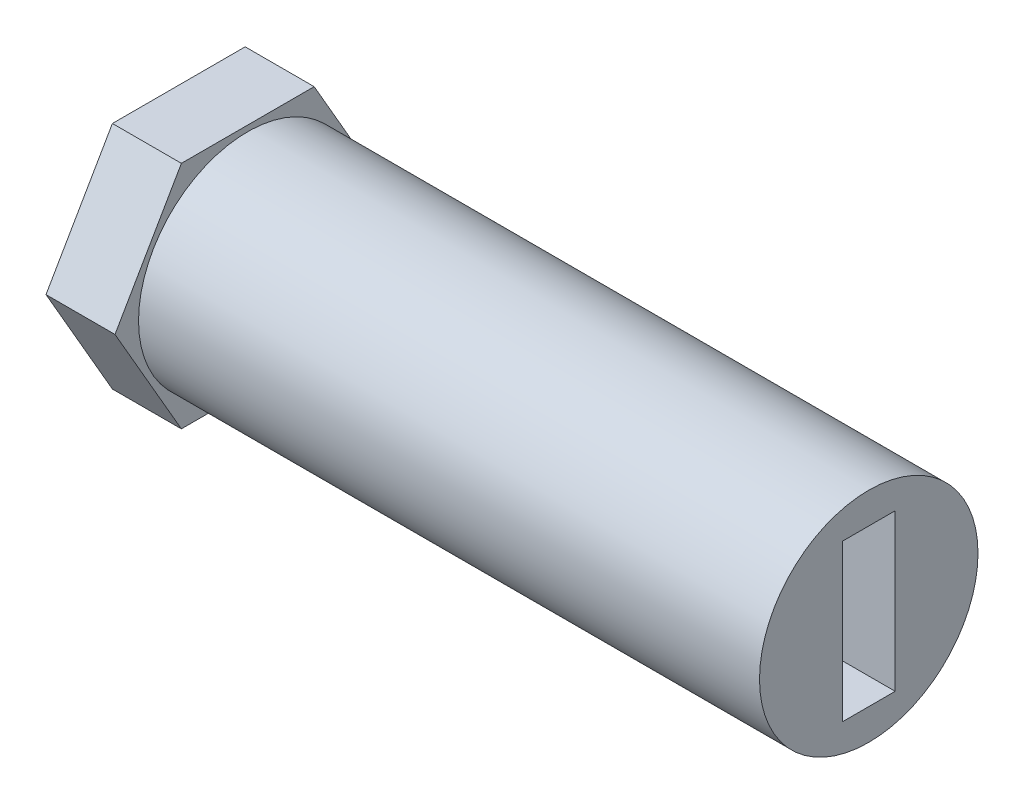
ISO-10303-21;
HEADER;
FILE_DESCRIPTION(('STEP AP214'),'2;1');
FILE_NAME('part.step','',(''),(''),'','','');
FILE_SCHEMA(('AUTOMOTIVE_DESIGN { 1 0 10303 214 1 1 1 1 }'));
ENDSEC;
DATA;
#1=APPLICATION_CONTEXT('core data for automotive mechanical design processes');
#2=APPLICATION_PROTOCOL_DEFINITION('international standard','automotive_design',2000,#1);
#3=PRODUCT_CONTEXT('',#1,'mechanical');
#4=PRODUCT('Part','Part','',(#3));
#5=PRODUCT_RELATED_PRODUCT_CATEGORY('part','',(#4));
#6=PRODUCT_DEFINITION_FORMATION('','',#4);
#7=PRODUCT_DEFINITION_CONTEXT('part definition',#1,'design');
#8=PRODUCT_DEFINITION('design','',#6,#7);
#9=PRODUCT_DEFINITION_SHAPE('','',#8);
#10=(LENGTH_UNIT() NAMED_UNIT(*) SI_UNIT(.MILLI.,.METRE.));
#11=(NAMED_UNIT(*) PLANE_ANGLE_UNIT() SI_UNIT($,.RADIAN.));
#12=(NAMED_UNIT(*) SI_UNIT($,.STERADIAN.) SOLID_ANGLE_UNIT());
#13=UNCERTAINTY_MEASURE_WITH_UNIT(LENGTH_MEASURE(1.E-05),#10,'distance_accuracy_value','');
#14=(GEOMETRIC_REPRESENTATION_CONTEXT(3) GLOBAL_UNCERTAINTY_ASSIGNED_CONTEXT((#13)) GLOBAL_UNIT_ASSIGNED_CONTEXT((#10,
#11,#12)) REPRESENTATION_CONTEXT('',''));
#15=CARTESIAN_POINT('',(0.,0.,0.));
#16=DIRECTION('',(0.,0.,1.));
#17=DIRECTION('',(1.,0.,0.));
#18=AXIS2_PLACEMENT_3D('',#15,#16,#17);
#19=CARTESIAN_POINT('',(30.,0.,0.));
#20=DIRECTION('',(-1.,0.,0.));
#21=DIRECTION('',(0.,0.,1.));
#22=AXIS2_PLACEMENT_3D('',#19,#20,#21);
#23=CYLINDRICAL_SURFACE('',#22,4.75);
#24=CARTESIAN_POINT('',(30.,0.,0.));
#25=DIRECTION('',(1.,0.,0.));
#26=DIRECTION('',(0.,0.,-1.));
#27=AXIS2_PLACEMENT_3D('',#24,#25,#26);
#28=CIRCLE('',#27,4.75);
#29=CARTESIAN_POINT('',(30.,0.,-4.75));
#30=VERTEX_POINT('',#29);
#31=EDGE_CURVE('E191',#30,#30,#28,.T.);
#32=ORIENTED_EDGE('',*,*,#31,.F.);
#33=EDGE_LOOP('',(#32));
#34=FACE_BOUND('',#33,.T.);
#35=CARTESIAN_POINT('',(3.,0.,0.));
#36=DIRECTION('',(-1.,0.,0.));
#37=DIRECTION('',(0.,0.,1.));
#38=AXIS2_PLACEMENT_3D('',#35,#36,#37);
#39=CIRCLE('',#38,4.75);
#40=CARTESIAN_POINT('',(3.,0.,4.75));
#41=VERTEX_POINT('',#40);
#42=EDGE_CURVE('E11',#41,#41,#39,.T.);
#43=ORIENTED_EDGE('',*,*,#42,.F.);
#44=EDGE_LOOP('',(#43));
#45=FACE_BOUND('',#44,.T.);
#46=ADVANCED_FACE('F33',(#34,#45),#23,.T.);
#47=CARTESIAN_POINT('',(-7.17843994193725,-3.4,-1.15));
#48=DIRECTION('',(0.,0.,-1.));
#49=DIRECTION('',(-1.,0.,0.));
#50=AXIS2_PLACEMENT_3D('',#47,#48,#49);
#51=PLANE('',#50);
#52=DIRECTION('',(0.,1.,0.));
#53=VECTOR('',#52,1.);
#54=CARTESIAN_POINT('',(3.,-3.4,-1.15));
#55=LINE('',#54,#53);
#56=CARTESIAN_POINT('',(3.,-3.4,-1.15));
#57=VERTEX_POINT('',#56);
#58=CARTESIAN_POINT('',(3.,3.4,-1.15));
#59=VERTEX_POINT('',#58);
#60=EDGE_CURVE('E48',#57,#59,#55,.T.);
#61=ORIENTED_EDGE('',*,*,#60,.F.);
#62=DIRECTION('',(1.,0.,0.));
#63=VECTOR('',#62,1.);
#64=CARTESIAN_POINT('',(-7.17843994193725,-3.4,-1.15));
#65=LINE('',#64,#63);
#66=CARTESIAN_POINT('',(30.,-3.4,-1.15));
#67=VERTEX_POINT('',#66);
#68=EDGE_CURVE('E189',#57,#67,#65,.T.);
#69=ORIENTED_EDGE('',*,*,#68,.T.);
#70=DIRECTION('',(0.,1.,0.));
#71=VECTOR('',#70,1.);
#72=CARTESIAN_POINT('',(30.,-3.4,-1.15));
#73=LINE('',#72,#71);
#74=CARTESIAN_POINT('',(30.,3.4,-1.15));
#75=VERTEX_POINT('',#74);
#76=EDGE_CURVE('E175',#67,#75,#73,.T.);
#77=ORIENTED_EDGE('',*,*,#76,.T.);
#78=DIRECTION('',(1.,0.,0.));
#79=VECTOR('',#78,1.);
#80=CARTESIAN_POINT('',(-7.17843994193725,3.4,-1.15));
#81=LINE('',#80,#79);
#82=EDGE_CURVE('E188',#59,#75,#81,.T.);
#83=ORIENTED_EDGE('',*,*,#82,.F.);
#84=EDGE_LOOP('',(#61,#69,#77,#83));
#85=FACE_BOUND('',#84,.T.);
#86=ADVANCED_FACE('F205',(#85),#51,.F.);
#87=CARTESIAN_POINT('',(-7.17843994193725,-3.4,1.15));
#88=DIRECTION('',(0.,-1.,0.));
#89=DIRECTION('',(0.,0.,-1.));
#90=AXIS2_PLACEMENT_3D('',#87,#88,#89);
#91=PLANE('',#90);
#92=DIRECTION('',(0.,0.,-1.));
#93=VECTOR('',#92,1.);
#94=CARTESIAN_POINT('',(3.,-3.4,1.15));
#95=LINE('',#94,#93);
#96=CARTESIAN_POINT('',(3.,-3.4,1.15));
#97=VERTEX_POINT('',#96);
#98=EDGE_CURVE('E55',#97,#57,#95,.T.);
#99=ORIENTED_EDGE('',*,*,#98,.F.);
#100=DIRECTION('',(1.,0.,0.));
#101=VECTOR('',#100,1.);
#102=CARTESIAN_POINT('',(-7.17843994193725,-3.4,1.15));
#103=LINE('',#102,#101);
#104=CARTESIAN_POINT('',(30.,-3.4,1.15));
#105=VERTEX_POINT('',#104);
#106=EDGE_CURVE('E192',#97,#105,#103,.T.);
#107=ORIENTED_EDGE('',*,*,#106,.T.);
#108=DIRECTION('',(0.,0.,-1.));
#109=VECTOR('',#108,1.);
#110=CARTESIAN_POINT('',(30.,-3.4,1.15));
#111=LINE('',#110,#109);
#112=EDGE_CURVE('E185',#105,#67,#111,.T.);
#113=ORIENTED_EDGE('',*,*,#112,.T.);
#114=ORIENTED_EDGE('',*,*,#68,.F.);
#115=EDGE_LOOP('',(#99,#107,#113,#114));
#116=FACE_BOUND('',#115,.T.);
#117=ADVANCED_FACE('F214',(#116),#91,.F.);
#118=CARTESIAN_POINT('',(-7.17843994193725,-3.4,1.15));
#119=DIRECTION('',(0.,0.,1.));
#120=DIRECTION('',(1.,0.,0.));
#121=AXIS2_PLACEMENT_3D('',#118,#119,#120);
#122=PLANE('',#121);
#123=DIRECTION('',(0.,-1.,0.));
#124=VECTOR('',#123,1.);
#125=CARTESIAN_POINT('',(3.,-3.4,1.15));
#126=LINE('',#125,#124);
#127=CARTESIAN_POINT('',(3.,3.4,1.15));
#128=VERTEX_POINT('',#127);
#129=EDGE_CURVE('E164',#128,#97,#126,.T.);
#130=ORIENTED_EDGE('',*,*,#129,.F.);
#131=DIRECTION('',(1.,0.,0.));
#132=VECTOR('',#131,1.);
#133=CARTESIAN_POINT('',(-7.17843994193725,3.4,1.15));
#134=LINE('',#133,#132);
#135=CARTESIAN_POINT('',(30.,3.4,1.15));
#136=VERTEX_POINT('',#135);
#137=EDGE_CURVE('E194',#128,#136,#134,.T.);
#138=ORIENTED_EDGE('',*,*,#137,.T.);
#139=DIRECTION('',(0.,-1.,0.));
#140=VECTOR('',#139,1.);
#141=CARTESIAN_POINT('',(30.,-3.4,1.15));
#142=LINE('',#141,#140);
#143=EDGE_CURVE('E182',#136,#105,#142,.T.);
#144=ORIENTED_EDGE('',*,*,#143,.T.);
#145=ORIENTED_EDGE('',*,*,#106,.F.);
#146=EDGE_LOOP('',(#130,#138,#144,#145));
#147=FACE_BOUND('',#146,.T.);
#148=ADVANCED_FACE('F213',(#147),#122,.F.);
#149=CARTESIAN_POINT('',(-7.17843994193725,3.4,1.15));
#150=DIRECTION('',(0.,1.,0.));
#151=DIRECTION('',(0.,0.,1.));
#152=AXIS2_PLACEMENT_3D('',#149,#150,#151);
#153=PLANE('',#152);
#154=DIRECTION('',(0.,0.,1.));
#155=VECTOR('',#154,1.);
#156=CARTESIAN_POINT('',(3.,3.4,1.15));
#157=LINE('',#156,#155);
#158=EDGE_CURVE('E36',#59,#128,#157,.T.);
#159=ORIENTED_EDGE('',*,*,#158,.F.);
#160=ORIENTED_EDGE('',*,*,#82,.T.);
#161=DIRECTION('',(0.,0.,1.));
#162=VECTOR('',#161,1.);
#163=CARTESIAN_POINT('',(30.,3.4,1.15));
#164=LINE('',#163,#162);
#165=EDGE_CURVE('E179',#75,#136,#164,.T.);
#166=ORIENTED_EDGE('',*,*,#165,.T.);
#167=ORIENTED_EDGE('',*,*,#137,.F.);
#168=EDGE_LOOP('',(#159,#160,#166,#167));
#169=FACE_BOUND('',#168,.T.);
#170=ADVANCED_FACE('F204',(#169),#153,.F.);
#171=CARTESIAN_POINT('',(30.,0.,0.));
#172=DIRECTION('',(1.,0.,0.));
#173=DIRECTION('',(0.,0.,-1.));
#174=AXIS2_PLACEMENT_3D('',#171,#172,#173);
#175=PLANE('',#174);
#176=ORIENTED_EDGE('',*,*,#76,.F.);
#177=ORIENTED_EDGE('',*,*,#112,.F.);
#178=ORIENTED_EDGE('',*,*,#143,.F.);
#179=ORIENTED_EDGE('',*,*,#165,.F.);
#180=EDGE_LOOP('',(#176,#177,#178,#179));
#181=FACE_BOUND('',#180,.T.);
#182=ORIENTED_EDGE('',*,*,#31,.T.);
#183=EDGE_LOOP('',(#182));
#184=FACE_BOUND('',#183,.T.);
#185=ADVANCED_FACE('F211',(#181,#184),#175,.T.);
#186=CARTESIAN_POINT('',(3.,0.,0.));
#187=DIRECTION('',(-1.,0.,0.));
#188=DIRECTION('',(0.,0.,1.));
#189=AXIS2_PLACEMENT_3D('',#186,#187,#188);
#190=PLANE('',#189);
#191=ORIENTED_EDGE('',*,*,#98,.T.);
#192=ORIENTED_EDGE('',*,*,#60,.T.);
#193=ORIENTED_EDGE('',*,*,#158,.T.);
#194=ORIENTED_EDGE('',*,*,#129,.T.);
#195=EDGE_LOOP('',(#191,#192,#193,#194));
#196=FACE_BOUND('',#195,.T.);
#197=ADVANCED_FACE('F201',(#196),#190,.F.);
#198=DIRECTION('',(0.,0.866025403784439,0.5));
#199=VECTOR('',#198,1.);
#200=CARTESIAN_POINT('',(3.,-5.,2.88675134594813));
#201=LINE('',#200,#199);
#202=CARTESIAN_POINT('',(3.,-5.,2.88675134594813));
#203=VERTEX_POINT('',#202);
#204=CARTESIAN_POINT('',(3.,0.,5.77350269189626));
#205=VERTEX_POINT('',#204);
#206=EDGE_CURVE('E130',#203,#205,#201,.T.);
#207=ORIENTED_EDGE('',*,*,#206,.F.);
#208=DIRECTION('',(0.,0.,1.));
#209=VECTOR('',#208,1.);
#210=CARTESIAN_POINT('',(3.,-5.,-2.88675134594813));
#211=LINE('',#210,#209);
#212=CARTESIAN_POINT('',(3.,-5.,-2.88675134594813));
#213=VERTEX_POINT('',#212);
#214=EDGE_CURVE('E122',#213,#203,#211,.T.);
#215=ORIENTED_EDGE('',*,*,#214,.F.);
#216=DIRECTION('',(0.,-0.866025403784438,0.5));
#217=VECTOR('',#216,1.);
#218=CARTESIAN_POINT('',(3.,0.,-5.77350269189626));
#219=LINE('',#218,#217);
#220=CARTESIAN_POINT('',(3.,0.,-5.77350269189626));
#221=VERTEX_POINT('',#220);
#222=EDGE_CURVE('E148',#221,#213,#219,.T.);
#223=ORIENTED_EDGE('',*,*,#222,.F.);
#224=DIRECTION('',(0.,-0.866025403784439,-0.5));
#225=VECTOR('',#224,1.);
#226=CARTESIAN_POINT('',(3.,5.00000000000001,-2.88675134594813));
#227=LINE('',#226,#225);
#228=CARTESIAN_POINT('',(3.,5.00000000000001,-2.88675134594813));
#229=VERTEX_POINT('',#228);
#230=EDGE_CURVE('E145',#229,#221,#227,.T.);
#231=ORIENTED_EDGE('',*,*,#230,.F.);
#232=DIRECTION('',(0.,0.,-1.));
#233=VECTOR('',#232,1.);
#234=CARTESIAN_POINT('',(3.,5.00000000000001,2.88675134594813));
#235=LINE('',#234,#233);
#236=CARTESIAN_POINT('',(3.,5.00000000000001,2.88675134594813));
#237=VERTEX_POINT('',#236);
#238=EDGE_CURVE('E134',#237,#229,#235,.T.);
#239=ORIENTED_EDGE('',*,*,#238,.F.);
#240=DIRECTION('',(0.,0.866025403784439,-0.5));
#241=VECTOR('',#240,1.);
#242=CARTESIAN_POINT('',(3.,0.,5.77350269189626));
#243=LINE('',#242,#241);
#244=EDGE_CURVE('E114',#205,#237,#243,.T.);
#245=ORIENTED_EDGE('',*,*,#244,.F.);
#246=EDGE_LOOP('',(#207,#215,#223,#231,#239,#245));
#247=FACE_BOUND('',#246,.T.);
#248=ORIENTED_EDGE('',*,*,#42,.T.);
#249=EDGE_LOOP('',(#248));
#250=FACE_BOUND('',#249,.T.);
#251=ADVANCED_FACE('F127',(#247,#250),#190,.F.);
#252=CARTESIAN_POINT('',(3.,-5.,2.88675134594813));
#253=DIRECTION('',(0.,-0.5,0.866025403784439));
#254=DIRECTION('',(0.,-0.866025403784439,-0.5));
#255=AXIS2_PLACEMENT_3D('',#252,#253,#254);
#256=PLANE('',#255);
#257=DIRECTION('',(0.,0.866025403784439,0.5));
#258=VECTOR('',#257,1.);
#259=CARTESIAN_POINT('',(0.,-5.,2.88675134594813));
#260=LINE('',#259,#258);
#261=CARTESIAN_POINT('',(0.,-5.,2.88675134594813));
#262=VERTEX_POINT('',#261);
#263=CARTESIAN_POINT('',(0.,0.,5.77350269189626));
#264=VERTEX_POINT('',#263);
#265=EDGE_CURVE('E152',#262,#264,#260,.T.);
#266=ORIENTED_EDGE('',*,*,#265,.F.);
#267=DIRECTION('',(-1.,0.,0.));
#268=VECTOR('',#267,1.);
#269=CARTESIAN_POINT('',(3.,-5.,2.88675134594813));
#270=LINE('',#269,#268);
#271=EDGE_CURVE('E137',#203,#262,#270,.T.);
#272=ORIENTED_EDGE('',*,*,#271,.F.);
#273=ORIENTED_EDGE('',*,*,#206,.T.);
#274=DIRECTION('',(-1.,0.,0.));
#275=VECTOR('',#274,1.);
#276=CARTESIAN_POINT('',(3.,0.,5.77350269189626));
#277=LINE('',#276,#275);
#278=EDGE_CURVE('E111',#205,#264,#277,.T.);
#279=ORIENTED_EDGE('',*,*,#278,.T.);
#280=EDGE_LOOP('',(#266,#272,#273,#279));
#281=FACE_BOUND('',#280,.T.);
#282=ADVANCED_FACE('F136',(#281),#256,.T.);
#283=CARTESIAN_POINT('',(3.,-5.,-2.88675134594813));
#284=DIRECTION('',(0.,-1.,0.));
#285=DIRECTION('',(0.,0.,-1.));
#286=AXIS2_PLACEMENT_3D('',#283,#284,#285);
#287=PLANE('',#286);
#288=DIRECTION('',(0.,0.,1.));
#289=VECTOR('',#288,1.);
#290=CARTESIAN_POINT('',(0.,-5.,-2.88675134594813));
#291=LINE('',#290,#289);
#292=CARTESIAN_POINT('',(0.,-5.,-2.88675134594813));
#293=VERTEX_POINT('',#292);
#294=EDGE_CURVE('E138',#293,#262,#291,.T.);
#295=ORIENTED_EDGE('',*,*,#294,.F.);
#296=DIRECTION('',(-1.,0.,0.));
#297=VECTOR('',#296,1.);
#298=CARTESIAN_POINT('',(3.,-5.,-2.88675134594813));
#299=LINE('',#298,#297);
#300=EDGE_CURVE('E165',#213,#293,#299,.T.);
#301=ORIENTED_EDGE('',*,*,#300,.F.);
#302=ORIENTED_EDGE('',*,*,#214,.T.);
#303=ORIENTED_EDGE('',*,*,#271,.T.);
#304=EDGE_LOOP('',(#295,#301,#302,#303));
#305=FACE_BOUND('',#304,.T.);
#306=ADVANCED_FACE('F236',(#305),#287,.T.);
#307=CARTESIAN_POINT('',(3.,0.,-5.77350269189626));
#308=DIRECTION('',(0.,-0.5,-0.866025403784439));
#309=DIRECTION('',(0.,0.866025403784439,-0.5));
#310=AXIS2_PLACEMENT_3D('',#307,#308,#309);
#311=PLANE('',#310);
#312=DIRECTION('',(0.,-0.866025403784438,0.5));
#313=VECTOR('',#312,1.);
#314=CARTESIAN_POINT('',(0.,0.,-5.77350269189626));
#315=LINE('',#314,#313);
#316=CARTESIAN_POINT('',(0.,0.,-5.77350269189626));
#317=VERTEX_POINT('',#316);
#318=EDGE_CURVE('E141',#317,#293,#315,.T.);
#319=ORIENTED_EDGE('',*,*,#318,.F.);
#320=DIRECTION('',(-1.,0.,0.));
#321=VECTOR('',#320,1.);
#322=CARTESIAN_POINT('',(3.,0.,-5.77350269189626));
#323=LINE('',#322,#321);
#324=EDGE_CURVE('E167',#221,#317,#323,.T.);
#325=ORIENTED_EDGE('',*,*,#324,.F.);
#326=ORIENTED_EDGE('',*,*,#222,.T.);
#327=ORIENTED_EDGE('',*,*,#300,.T.);
#328=EDGE_LOOP('',(#319,#325,#326,#327));
#329=FACE_BOUND('',#328,.T.);
#330=ADVANCED_FACE('F240',(#329),#311,.T.);
#331=CARTESIAN_POINT('',(3.,5.00000000000001,-2.88675134594813));
#332=DIRECTION('',(0.,0.5,-0.866025403784439));
#333=DIRECTION('',(0.,0.866025403784439,0.5));
#334=AXIS2_PLACEMENT_3D('',#331,#332,#333);
#335=PLANE('',#334);
#336=DIRECTION('',(0.,-0.866025403784439,-0.5));
#337=VECTOR('',#336,1.);
#338=CARTESIAN_POINT('',(0.,5.00000000000001,-2.88675134594813));
#339=LINE('',#338,#337);
#340=CARTESIAN_POINT('',(0.,5.00000000000001,-2.88675134594813));
#341=VERTEX_POINT('',#340);
#342=EDGE_CURVE('E158',#341,#317,#339,.T.);
#343=ORIENTED_EDGE('',*,*,#342,.F.);
#344=DIRECTION('',(-1.,0.,0.));
#345=VECTOR('',#344,1.);
#346=CARTESIAN_POINT('',(3.,5.00000000000001,-2.88675134594813));
#347=LINE('',#346,#345);
#348=EDGE_CURVE('E169',#229,#341,#347,.T.);
#349=ORIENTED_EDGE('',*,*,#348,.F.);
#350=ORIENTED_EDGE('',*,*,#230,.T.);
#351=ORIENTED_EDGE('',*,*,#324,.T.);
#352=EDGE_LOOP('',(#343,#349,#350,#351));
#353=FACE_BOUND('',#352,.T.);
#354=ADVANCED_FACE('F244',(#353),#335,.T.);
#355=CARTESIAN_POINT('',(3.,5.00000000000001,2.88675134594813));
#356=DIRECTION('',(0.,1.,0.));
#357=DIRECTION('',(0.,0.,1.));
#358=AXIS2_PLACEMENT_3D('',#355,#356,#357);
#359=PLANE('',#358);
#360=DIRECTION('',(0.,0.,-1.));
#361=VECTOR('',#360,1.);
#362=CARTESIAN_POINT('',(0.,5.00000000000001,2.88675134594813));
#363=LINE('',#362,#361);
#364=CARTESIAN_POINT('',(0.,5.00000000000001,2.88675134594813));
#365=VERTEX_POINT('',#364);
#366=EDGE_CURVE('E155',#365,#341,#363,.T.);
#367=ORIENTED_EDGE('',*,*,#366,.F.);
#368=DIRECTION('',(-1.,0.,0.));
#369=VECTOR('',#368,1.);
#370=CARTESIAN_POINT('',(3.,5.00000000000001,2.88675134594813));
#371=LINE('',#370,#369);
#372=EDGE_CURVE('E121',#237,#365,#371,.T.);
#373=ORIENTED_EDGE('',*,*,#372,.F.);
#374=ORIENTED_EDGE('',*,*,#238,.T.);
#375=ORIENTED_EDGE('',*,*,#348,.T.);
#376=EDGE_LOOP('',(#367,#373,#374,#375));
#377=FACE_BOUND('',#376,.T.);
#378=ADVANCED_FACE('F248',(#377),#359,.T.);
#379=CARTESIAN_POINT('',(3.,0.,5.77350269189626));
#380=DIRECTION('',(0.,0.5,0.866025403784439));
#381=DIRECTION('',(0.,-0.866025403784439,0.5));
#382=AXIS2_PLACEMENT_3D('',#379,#380,#381);
#383=PLANE('',#382);
#384=DIRECTION('',(0.,0.866025403784439,-0.5));
#385=VECTOR('',#384,1.);
#386=CARTESIAN_POINT('',(0.,0.,5.77350269189626));
#387=LINE('',#386,#385);
#388=EDGE_CURVE('E116',#264,#365,#387,.T.);
#389=ORIENTED_EDGE('',*,*,#388,.F.);
#390=ORIENTED_EDGE('',*,*,#278,.F.);
#391=ORIENTED_EDGE('',*,*,#244,.T.);
#392=ORIENTED_EDGE('',*,*,#372,.T.);
#393=EDGE_LOOP('',(#389,#390,#391,#392));
#394=FACE_BOUND('',#393,.T.);
#395=ADVANCED_FACE('F113',(#394),#383,.T.);
#396=CARTESIAN_POINT('',(0.,0.,0.));
#397=DIRECTION('',(1.,0.,0.));
#398=DIRECTION('',(0.,0.,-1.));
#399=AXIS2_PLACEMENT_3D('',#396,#397,#398);
#400=PLANE('',#399);
#401=ORIENTED_EDGE('',*,*,#265,.T.);
#402=ORIENTED_EDGE('',*,*,#388,.T.);
#403=ORIENTED_EDGE('',*,*,#366,.T.);
#404=ORIENTED_EDGE('',*,*,#342,.T.);
#405=ORIENTED_EDGE('',*,*,#318,.T.);
#406=ORIENTED_EDGE('',*,*,#294,.T.);
#407=EDGE_LOOP('',(#401,#402,#403,#404,#405,#406));
#408=FACE_BOUND('',#407,.T.);
#409=ADVANCED_FACE('F254',(#408),#400,.F.);
#410=CLOSED_SHELL('',(#46,#86,#117,#148,#170,#185,#197,#251,#282,#306,#330,#354,#378,#395,#409));
#411=MANIFOLD_SOLID_BREP('B2',#410);
#412=ADVANCED_BREP_SHAPE_REPRESENTATION('',(#18,#411),#14);
#413=SHAPE_DEFINITION_REPRESENTATION(#9,#412);
ENDSEC;
END-ISO-10303-21;
